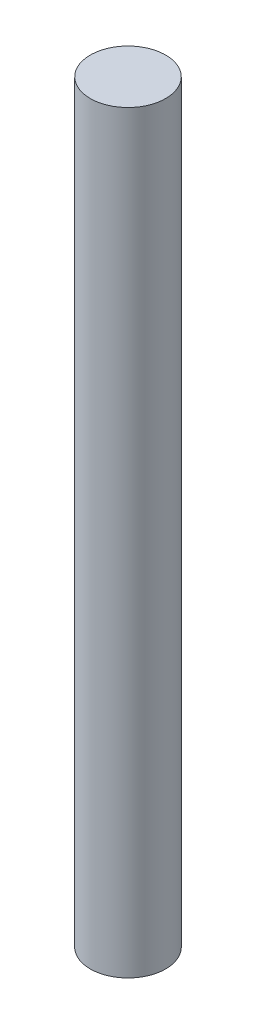
ISO-10303-21;
HEADER;
FILE_DESCRIPTION(('STEP AP214'),'2;1');
FILE_NAME('part.step','',(''),(''),'','','');
FILE_SCHEMA(('AUTOMOTIVE_DESIGN { 1 0 10303 214 1 1 1 1 }'));
ENDSEC;
DATA;
#1=APPLICATION_CONTEXT('core data for automotive mechanical design processes');
#2=APPLICATION_PROTOCOL_DEFINITION('international standard','automotive_design',2000,#1);
#3=PRODUCT_CONTEXT('',#1,'mechanical');
#4=PRODUCT('Part','Part','',(#3));
#5=PRODUCT_RELATED_PRODUCT_CATEGORY('part','',(#4));
#6=PRODUCT_DEFINITION_FORMATION('','',#4);
#7=PRODUCT_DEFINITION_CONTEXT('part definition',#1,'design');
#8=PRODUCT_DEFINITION('design','',#6,#7);
#9=PRODUCT_DEFINITION_SHAPE('','',#8);
#10=(LENGTH_UNIT() NAMED_UNIT(*) SI_UNIT(.MILLI.,.METRE.));
#11=(NAMED_UNIT(*) PLANE_ANGLE_UNIT() SI_UNIT($,.RADIAN.));
#12=(NAMED_UNIT(*) SI_UNIT($,.STERADIAN.) SOLID_ANGLE_UNIT());
#13=UNCERTAINTY_MEASURE_WITH_UNIT(LENGTH_MEASURE(1.E-05),#10,'distance_accuracy_value','');
#14=(GEOMETRIC_REPRESENTATION_CONTEXT(3) GLOBAL_UNCERTAINTY_ASSIGNED_CONTEXT((#13)) GLOBAL_UNIT_ASSIGNED_CONTEXT((#10,
#11,#12)) REPRESENTATION_CONTEXT('',''));
#15=CARTESIAN_POINT('',(0.,0.,0.));
#16=DIRECTION('',(0.,0.,1.));
#17=DIRECTION('',(1.,0.,0.));
#18=AXIS2_PLACEMENT_3D('',#15,#16,#17);
#19=CARTESIAN_POINT('',(0.,400.,0.));
#20=DIRECTION('',(0.,-1.,0.));
#21=DIRECTION('',(0.,0.,-1.));
#22=AXIS2_PLACEMENT_3D('',#19,#20,#21);
#23=CYLINDRICAL_SURFACE('',#22,20.);
#24=CARTESIAN_POINT('',(0.,400.,0.));
#25=DIRECTION('',(0.,1.,0.));
#26=DIRECTION('',(0.,0.,1.));
#27=AXIS2_PLACEMENT_3D('',#24,#25,#26);
#28=CIRCLE('',#27,20.);
#29=CARTESIAN_POINT('',(0.,400.,20.));
#30=VERTEX_POINT('',#29);
#31=EDGE_CURVE('E10',#30,#30,#28,.T.);
#32=ORIENTED_EDGE('',*,*,#31,.F.);
#33=EDGE_LOOP('',(#32));
#34=FACE_BOUND('',#33,.T.);
#35=CARTESIAN_POINT('',(0.,0.,0.));
#36=DIRECTION('',(0.,1.,0.));
#37=DIRECTION('',(0.,0.,1.));
#38=AXIS2_PLACEMENT_3D('',#35,#36,#37);
#39=CIRCLE('',#38,20.);
#40=CARTESIAN_POINT('',(0.,0.,20.));
#41=VERTEX_POINT('',#40);
#42=EDGE_CURVE('E40',#41,#41,#39,.T.);
#43=ORIENTED_EDGE('',*,*,#42,.T.);
#44=EDGE_LOOP('',(#43));
#45=FACE_BOUND('',#44,.T.);
#46=ADVANCED_FACE('F37',(#34,#45),#23,.T.);
#47=CARTESIAN_POINT('',(0.,400.,0.));
#48=DIRECTION('',(0.,1.,0.));
#49=DIRECTION('',(0.,0.,1.));
#50=AXIS2_PLACEMENT_3D('',#47,#48,#49);
#51=PLANE('',#50);
#52=ORIENTED_EDGE('',*,*,#31,.T.);
#53=EDGE_LOOP('',(#52));
#54=FACE_BOUND('',#53,.T.);
#55=ADVANCED_FACE('F54',(#54),#51,.T.);
#56=CARTESIAN_POINT('',(0.,0.,0.));
#57=DIRECTION('',(0.,1.,0.));
#58=DIRECTION('',(0.,0.,1.));
#59=AXIS2_PLACEMENT_3D('',#56,#57,#58);
#60=PLANE('',#59);
#61=ORIENTED_EDGE('',*,*,#42,.F.);
#62=EDGE_LOOP('',(#61));
#63=FACE_BOUND('',#62,.T.);
#64=ADVANCED_FACE('F52',(#63),#60,.F.);
#65=CLOSED_SHELL('',(#46,#55,#64));
#66=MANIFOLD_SOLID_BREP('B2',#65);
#67=ADVANCED_BREP_SHAPE_REPRESENTATION('',(#18,#66),#14);
#68=SHAPE_DEFINITION_REPRESENTATION(#9,#67);
ENDSEC;
END-ISO-10303-21;
